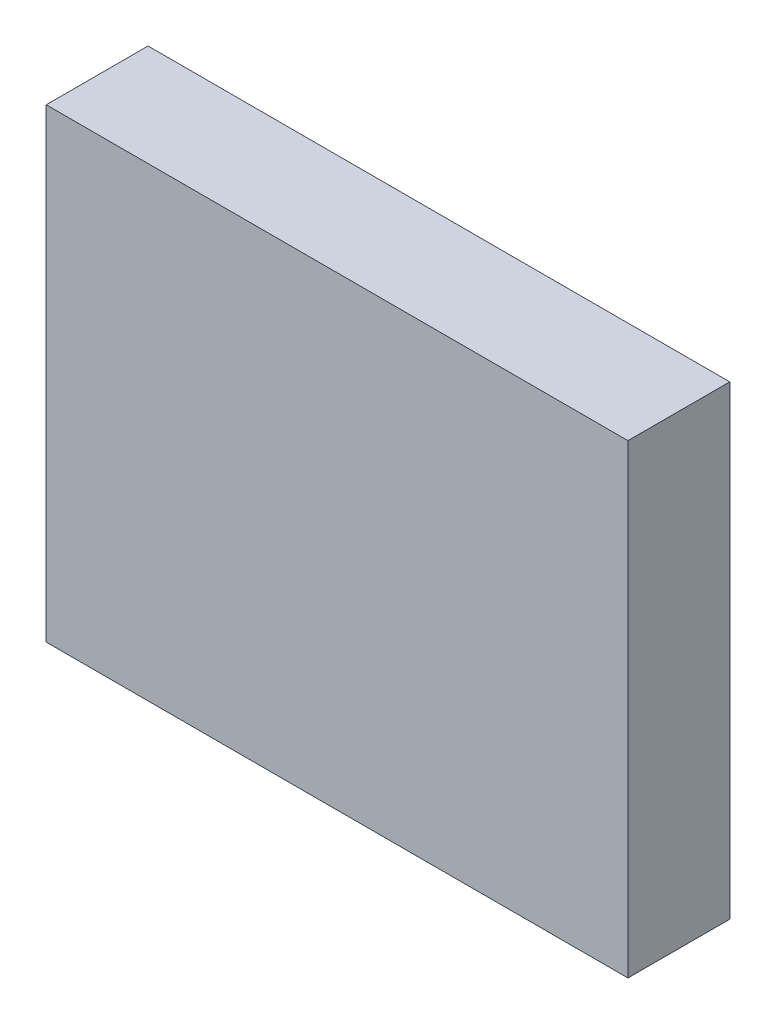
ISO-10303-21;
HEADER;
FILE_DESCRIPTION(('STEP AP214'),'2;1');
FILE_NAME('part.step','',(''),(''),'','','');
FILE_SCHEMA(('AUTOMOTIVE_DESIGN { 1 0 10303 214 1 1 1 1 }'));
ENDSEC;
DATA;
#1=APPLICATION_CONTEXT('core data for automotive mechanical design processes');
#2=APPLICATION_PROTOCOL_DEFINITION('international standard','automotive_design',2000,#1);
#3=PRODUCT_CONTEXT('',#1,'mechanical');
#4=PRODUCT('Part','Part','',(#3));
#5=PRODUCT_RELATED_PRODUCT_CATEGORY('part','',(#4));
#6=PRODUCT_DEFINITION_FORMATION('','',#4);
#7=PRODUCT_DEFINITION_CONTEXT('part definition',#1,'design');
#8=PRODUCT_DEFINITION('design','',#6,#7);
#9=PRODUCT_DEFINITION_SHAPE('','',#8);
#10=(LENGTH_UNIT() NAMED_UNIT(*) SI_UNIT(.MILLI.,.METRE.));
#11=(NAMED_UNIT(*) PLANE_ANGLE_UNIT() SI_UNIT($,.RADIAN.));
#12=(NAMED_UNIT(*) SI_UNIT($,.STERADIAN.) SOLID_ANGLE_UNIT());
#13=UNCERTAINTY_MEASURE_WITH_UNIT(LENGTH_MEASURE(1.E-05),#10,'distance_accuracy_value','');
#14=(GEOMETRIC_REPRESENTATION_CONTEXT(3) GLOBAL_UNCERTAINTY_ASSIGNED_CONTEXT((#13)) GLOBAL_UNIT_ASSIGNED_CONTEXT((#10,
#11,#12)) REPRESENTATION_CONTEXT('',''));
#15=CARTESIAN_POINT('',(0.,0.,0.));
#16=DIRECTION('',(0.,0.,1.));
#17=DIRECTION('',(1.,0.,0.));
#18=AXIS2_PLACEMENT_3D('',#15,#16,#17);
#19=CARTESIAN_POINT('',(-2.00000108,-1.59999934,0.70000114));
#20=DIRECTION('',(0.,0.,-1.));
#21=DIRECTION('',(-1.,0.,0.));
#22=AXIS2_PLACEMENT_3D('',#19,#20,#21);
#23=PLANE('',#22);
#24=DIRECTION('',(0.,1.,0.));
#25=VECTOR('',#24,1.);
#26=CARTESIAN_POINT('',(2.00000108,-1.59999934,0.70000114));
#27=LINE('',#26,#25);
#28=CARTESIAN_POINT('',(2.00000108,-1.59999934,0.70000114));
#29=VERTEX_POINT('',#28);
#30=CARTESIAN_POINT('',(2.00000108,1.59999934,0.70000114));
#31=VERTEX_POINT('',#30);
#32=EDGE_CURVE('E54',#29,#31,#27,.T.);
#33=ORIENTED_EDGE('',*,*,#32,.T.);
#34=DIRECTION('',(1.,0.,0.));
#35=VECTOR('',#34,1.);
#36=CARTESIAN_POINT('',(2.00000108,1.59999934,0.70000114));
#37=LINE('',#36,#35);
#38=CARTESIAN_POINT('',(-2.00000108,1.59999934,0.70000114));
#39=VERTEX_POINT('',#38);
#40=EDGE_CURVE('E56',#31,#39,#37,.F.);
#41=ORIENTED_EDGE('',*,*,#40,.T.);
#42=DIRECTION('',(0.,1.,0.));
#43=VECTOR('',#42,1.);
#44=CARTESIAN_POINT('',(-2.00000108,1.59999934,0.70000114));
#45=LINE('',#44,#43);
#46=CARTESIAN_POINT('',(-2.00000108,-1.59999934,0.70000114));
#47=VERTEX_POINT('',#46);
#48=EDGE_CURVE('E19',#39,#47,#45,.F.);
#49=ORIENTED_EDGE('',*,*,#48,.T.);
#50=DIRECTION('',(1.,0.,0.));
#51=VECTOR('',#50,1.);
#52=CARTESIAN_POINT('',(-2.00000108,-1.59999934,0.70000114));
#53=LINE('',#52,#51);
#54=EDGE_CURVE('E79',#47,#29,#53,.T.);
#55=ORIENTED_EDGE('',*,*,#54,.T.);
#56=EDGE_LOOP('',(#33,#41,#49,#55));
#57=FACE_BOUND('',#56,.T.);
#58=ADVANCED_FACE('F16',(#57),#23,.F.);
#59=CARTESIAN_POINT('',(-2.00000108,1.59999934,0.));
#60=DIRECTION('',(1.,0.,0.));
#61=DIRECTION('',(0.,0.,-1.));
#62=AXIS2_PLACEMENT_3D('',#59,#60,#61);
#63=PLANE('',#62);
#64=DIRECTION('',(0.,0.,1.));
#65=VECTOR('',#64,1.);
#66=CARTESIAN_POINT('',(-2.00000108,-1.59999934,0.));
#67=LINE('',#66,#65);
#68=CARTESIAN_POINT('',(-2.00000108,-1.59999934,0.));
#69=VERTEX_POINT('',#68);
#70=EDGE_CURVE('E67',#69,#47,#67,.T.);
#71=ORIENTED_EDGE('',*,*,#70,.T.);
#72=ORIENTED_EDGE('',*,*,#48,.F.);
#73=DIRECTION('',(0.,0.,-1.));
#74=VECTOR('',#73,1.);
#75=CARTESIAN_POINT('',(-2.00000108,1.59999934,0.));
#76=LINE('',#75,#74);
#77=CARTESIAN_POINT('',(-2.00000108,1.59999934,0.));
#78=VERTEX_POINT('',#77);
#79=EDGE_CURVE('E62',#39,#78,#76,.T.);
#80=ORIENTED_EDGE('',*,*,#79,.T.);
#81=DIRECTION('',(0.,1.,0.));
#82=VECTOR('',#81,1.);
#83=CARTESIAN_POINT('',(-2.00000108,-1.59999934,0.));
#84=LINE('',#83,#82);
#85=EDGE_CURVE('E82',#69,#78,#84,.T.);
#86=ORIENTED_EDGE('',*,*,#85,.F.);
#87=EDGE_LOOP('',(#71,#72,#80,#86));
#88=FACE_BOUND('',#87,.T.);
#89=ADVANCED_FACE('F64',(#88),#63,.F.);
#90=CARTESIAN_POINT('',(2.00000108,1.59999934,0.));
#91=DIRECTION('',(0.,-1.,0.));
#92=DIRECTION('',(0.,0.,-1.));
#93=AXIS2_PLACEMENT_3D('',#90,#91,#92);
#94=PLANE('',#93);
#95=ORIENTED_EDGE('',*,*,#79,.F.);
#96=ORIENTED_EDGE('',*,*,#40,.F.);
#97=DIRECTION('',(0.,0.,1.));
#98=VECTOR('',#97,1.);
#99=CARTESIAN_POINT('',(2.00000108,1.59999934,0.));
#100=LINE('',#99,#98);
#101=CARTESIAN_POINT('',(2.00000108,1.59999934,0.));
#102=VERTEX_POINT('',#101);
#103=EDGE_CURVE('E74',#31,#102,#100,.F.);
#104=ORIENTED_EDGE('',*,*,#103,.T.);
#105=DIRECTION('',(-1.,0.,0.));
#106=VECTOR('',#105,1.);
#107=CARTESIAN_POINT('',(-2.00000108,1.59999934,0.));
#108=LINE('',#107,#106);
#109=EDGE_CURVE('E71',#78,#102,#108,.F.);
#110=ORIENTED_EDGE('',*,*,#109,.F.);
#111=EDGE_LOOP('',(#95,#96,#104,#110));
#112=FACE_BOUND('',#111,.T.);
#113=ADVANCED_FACE('F69',(#112),#94,.F.);
#114=CARTESIAN_POINT('',(2.00000108,-1.59999934,0.));
#115=DIRECTION('',(-1.,0.,0.));
#116=DIRECTION('',(0.,0.,1.));
#117=AXIS2_PLACEMENT_3D('',#114,#115,#116);
#118=PLANE('',#117);
#119=ORIENTED_EDGE('',*,*,#103,.F.);
#120=ORIENTED_EDGE('',*,*,#32,.F.);
#121=DIRECTION('',(0.,0.,1.));
#122=VECTOR('',#121,1.);
#123=CARTESIAN_POINT('',(2.00000108,-1.59999934,0.));
#124=LINE('',#123,#122);
#125=CARTESIAN_POINT('',(2.00000108,-1.59999934,0.));
#126=VERTEX_POINT('',#125);
#127=EDGE_CURVE('E34',#29,#126,#124,.F.);
#128=ORIENTED_EDGE('',*,*,#127,.T.);
#129=DIRECTION('',(0.,1.,0.));
#130=VECTOR('',#129,1.);
#131=CARTESIAN_POINT('',(2.00000108,-1.59999934,0.));
#132=LINE('',#131,#130);
#133=EDGE_CURVE('E25',#102,#126,#132,.F.);
#134=ORIENTED_EDGE('',*,*,#133,.F.);
#135=EDGE_LOOP('',(#119,#120,#128,#134));
#136=FACE_BOUND('',#135,.T.);
#137=ADVANCED_FACE('F88',(#136),#118,.F.);
#138=CARTESIAN_POINT('',(-2.00000108,-1.59999934,0.));
#139=DIRECTION('',(0.,1.,0.));
#140=DIRECTION('',(0.,0.,1.));
#141=AXIS2_PLACEMENT_3D('',#138,#139,#140);
#142=PLANE('',#141);
#143=ORIENTED_EDGE('',*,*,#127,.F.);
#144=ORIENTED_EDGE('',*,*,#54,.F.);
#145=ORIENTED_EDGE('',*,*,#70,.F.);
#146=DIRECTION('',(-1.,0.,0.));
#147=VECTOR('',#146,1.);
#148=CARTESIAN_POINT('',(-2.00000108,-1.59999934,0.));
#149=LINE('',#148,#147);
#150=EDGE_CURVE('E11',#126,#69,#149,.T.);
#151=ORIENTED_EDGE('',*,*,#150,.F.);
#152=EDGE_LOOP('',(#143,#144,#145,#151));
#153=FACE_BOUND('',#152,.T.);
#154=ADVANCED_FACE('F90',(#153),#142,.F.);
#155=CARTESIAN_POINT('',(-2.00000108,-1.59999934,0.));
#156=DIRECTION('',(0.,0.,-1.));
#157=DIRECTION('',(-1.,0.,0.));
#158=AXIS2_PLACEMENT_3D('',#155,#156,#157);
#159=PLANE('',#158);
#160=ORIENTED_EDGE('',*,*,#133,.T.);
#161=ORIENTED_EDGE('',*,*,#150,.T.);
#162=ORIENTED_EDGE('',*,*,#85,.T.);
#163=ORIENTED_EDGE('',*,*,#109,.T.);
#164=EDGE_LOOP('',(#160,#161,#162,#163));
#165=FACE_BOUND('',#164,.T.);
#166=ADVANCED_FACE('F87',(#165),#159,.T.);
#167=CLOSED_SHELL('',(#58,#89,#113,#137,#154,#166));
#168=MANIFOLD_SOLID_BREP('B1',#167);
#169=ADVANCED_BREP_SHAPE_REPRESENTATION('',(#18,#168),#14);
#170=SHAPE_DEFINITION_REPRESENTATION(#9,#169);
ENDSEC;
END-ISO-10303-21;
